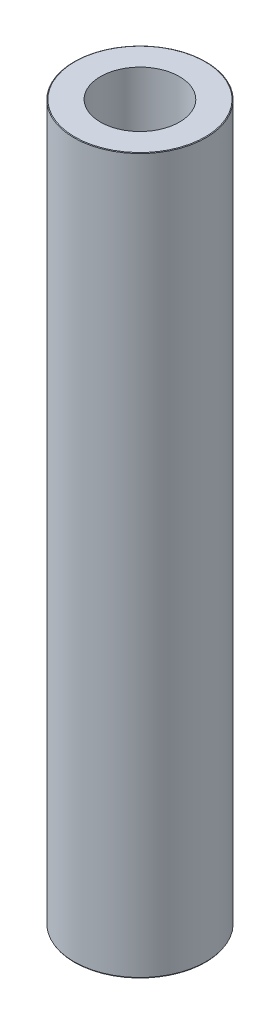
ISO-10303-21;
HEADER;
FILE_DESCRIPTION(('STEP AP214'),'2;1');
FILE_NAME('part.step','',(''),(''),'','','');
FILE_SCHEMA(('AUTOMOTIVE_DESIGN { 1 0 10303 214 1 1 1 1 }'));
ENDSEC;
DATA;
#1=APPLICATION_CONTEXT('core data for automotive mechanical design processes');
#2=APPLICATION_PROTOCOL_DEFINITION('international standard','automotive_design',2000,#1);
#3=PRODUCT_CONTEXT('',#1,'mechanical');
#4=PRODUCT('Part','Part','',(#3));
#5=PRODUCT_RELATED_PRODUCT_CATEGORY('part','',(#4));
#6=PRODUCT_DEFINITION_FORMATION('','',#4);
#7=PRODUCT_DEFINITION_CONTEXT('part definition',#1,'design');
#8=PRODUCT_DEFINITION('design','',#6,#7);
#9=PRODUCT_DEFINITION_SHAPE('','',#8);
#10=(LENGTH_UNIT() NAMED_UNIT(*) SI_UNIT(.MILLI.,.METRE.));
#11=(NAMED_UNIT(*) PLANE_ANGLE_UNIT() SI_UNIT($,.RADIAN.));
#12=(NAMED_UNIT(*) SI_UNIT($,.STERADIAN.) SOLID_ANGLE_UNIT());
#13=UNCERTAINTY_MEASURE_WITH_UNIT(LENGTH_MEASURE(1.E-05),#10,'distance_accuracy_value','');
#14=(GEOMETRIC_REPRESENTATION_CONTEXT(3) GLOBAL_UNCERTAINTY_ASSIGNED_CONTEXT((#13)) GLOBAL_UNIT_ASSIGNED_CONTEXT((#10,
#11,#12)) REPRESENTATION_CONTEXT('',''));
#15=CARTESIAN_POINT('',(0.,0.,0.));
#16=DIRECTION('',(0.,0.,1.));
#17=DIRECTION('',(1.,0.,0.));
#18=AXIS2_PLACEMENT_3D('',#15,#16,#17);
#19=CARTESIAN_POINT('',(0.,433.719628147635,0.));
#20=DIRECTION('',(0.,-1.,0.));
#21=DIRECTION('',(0.,0.,-1.));
#22=AXIS2_PLACEMENT_3D('',#19,#20,#21);
#23=CYLINDRICAL_SURFACE('',#22,40.);
#24=CARTESIAN_POINT('',(0.,433.463543889906,0.));
#25=DIRECTION('',(0.,1.,0.));
#26=DIRECTION('',(0.,0.,1.));
#27=AXIS2_PLACEMENT_3D('',#24,#25,#26);
#28=CIRCLE('',#27,40.);
#29=CARTESIAN_POINT('',(0.,433.463543889906,40.));
#30=VERTEX_POINT('',#29);
#31=EDGE_CURVE('E50',#30,#30,#28,.F.);
#32=ORIENTED_EDGE('',*,*,#31,.T.);
#33=EDGE_LOOP('',(#32));
#34=FACE_BOUND('',#33,.T.);
#35=CARTESIAN_POINT('',(0.,0.443550945404214,0.));
#36=DIRECTION('',(0.,1.,0.));
#37=DIRECTION('',(0.,0.,1.));
#38=AXIS2_PLACEMENT_3D('',#35,#36,#37);
#39=CIRCLE('',#38,40.);
#40=CARTESIAN_POINT('',(0.,0.443550945404214,40.));
#41=VERTEX_POINT('',#40);
#42=EDGE_CURVE('E51',#41,#41,#39,.T.);
#43=ORIENTED_EDGE('',*,*,#42,.T.);
#44=EDGE_LOOP('',(#43));
#45=FACE_BOUND('',#44,.T.);
#46=ADVANCED_FACE('F39',(#34,#45),#23,.T.);
#47=CARTESIAN_POINT('',(0.,433.719628147635,0.));
#48=DIRECTION('',(0.,1.,0.));
#49=DIRECTION('',(0.,0.,1.));
#50=AXIS2_PLACEMENT_3D('',#47,#48,#49);
#51=PLANE('',#50);
#52=CARTESIAN_POINT('',(0.,433.719628147635,0.));
#53=DIRECTION('',(0.,1.,0.));
#54=DIRECTION('',(0.,0.,1.));
#55=AXIS2_PLACEMENT_3D('',#52,#53,#54);
#56=CIRCLE('',#55,39.5564490545958);
#57=CARTESIAN_POINT('',(0.,433.719628147635,39.5564490545958));
#58=VERTEX_POINT('',#57);
#59=EDGE_CURVE('E54',#58,#58,#56,.T.);
#60=ORIENTED_EDGE('',*,*,#59,.T.);
#61=EDGE_LOOP('',(#60));
#62=FACE_BOUND('',#61,.T.);
#63=CARTESIAN_POINT('',(0.,433.719628147635,0.));
#64=DIRECTION('',(0.,1.,0.));
#65=DIRECTION('',(0.,0.,1.));
#66=AXIS2_PLACEMENT_3D('',#63,#64,#65);
#67=CIRCLE('',#66,23.9783136016817);
#68=CARTESIAN_POINT('',(0.,433.719628147635,23.9783136016817));
#69=VERTEX_POINT('',#68);
#70=EDGE_CURVE('E58',#69,#69,#67,.T.);
#71=ORIENTED_EDGE('',*,*,#70,.F.);
#72=EDGE_LOOP('',(#71));
#73=FACE_BOUND('',#72,.T.);
#74=ADVANCED_FACE('F69',(#62,#73),#51,.T.);
#75=CARTESIAN_POINT('',(0.,0.,0.));
#76=DIRECTION('',(0.,1.,0.));
#77=DIRECTION('',(0.,0.,1.));
#78=AXIS2_PLACEMENT_3D('',#75,#76,#77);
#79=PLANE('',#78);
#80=CARTESIAN_POINT('',(0.,0.,0.));
#81=DIRECTION('',(0.,1.,0.));
#82=DIRECTION('',(0.,0.,1.));
#83=AXIS2_PLACEMENT_3D('',#80,#81,#82);
#84=CIRCLE('',#83,39.7439157422716);
#85=CARTESIAN_POINT('',(0.,0.,39.7439157422716));
#86=VERTEX_POINT('',#85);
#87=EDGE_CURVE('E10',#86,#86,#84,.F.);
#88=ORIENTED_EDGE('',*,*,#87,.T.);
#89=EDGE_LOOP('',(#88));
#90=FACE_BOUND('',#89,.T.);
#91=CARTESIAN_POINT('',(0.,0.,0.));
#92=DIRECTION('',(0.,1.,0.));
#93=DIRECTION('',(0.,0.,1.));
#94=AXIS2_PLACEMENT_3D('',#91,#92,#93);
#95=CIRCLE('',#94,23.9783136016817);
#96=CARTESIAN_POINT('',(0.,0.,23.9783136016817));
#97=VERTEX_POINT('',#96);
#98=EDGE_CURVE('E63',#97,#97,#95,.T.);
#99=ORIENTED_EDGE('',*,*,#98,.T.);
#100=EDGE_LOOP('',(#99));
#101=FACE_BOUND('',#100,.T.);
#102=ADVANCED_FACE('F75',(#90,#101),#79,.F.);
#103=CARTESIAN_POINT('',(0.,433.719628147635,0.));
#104=DIRECTION('',(0.,-1.,0.));
#105=DIRECTION('',(0.,0.,-1.));
#106=AXIS2_PLACEMENT_3D('',#103,#104,#105);
#107=CYLINDRICAL_SURFACE('',#106,23.9783136016817);
#108=ORIENTED_EDGE('',*,*,#70,.T.);
#109=EDGE_LOOP('',(#108));
#110=FACE_BOUND('',#109,.T.);
#111=ORIENTED_EDGE('',*,*,#98,.F.);
#112=EDGE_LOOP('',(#111));
#113=FACE_BOUND('',#112,.T.);
#114=ADVANCED_FACE('F70',(#110,#113),#107,.F.);
#115=CARTESIAN_POINT('',(0.,433.719628147635,0.));
#116=DIRECTION('',(0.,-1.,0.));
#117=DIRECTION('',(0.,0.,-1.));
#118=AXIS2_PLACEMENT_3D('',#115,#116,#117);
#119=CONICAL_SURFACE('',#118,39.5564490545958,1.04719755119656);
#120=ORIENTED_EDGE('',*,*,#31,.F.);
#121=EDGE_LOOP('',(#120));
#122=FACE_BOUND('',#121,.T.);
#123=ORIENTED_EDGE('',*,*,#59,.F.);
#124=EDGE_LOOP('',(#123));
#125=FACE_BOUND('',#124,.T.);
#126=ADVANCED_FACE('F81',(#122,#125),#119,.T.);
#127=CARTESIAN_POINT('',(0.,0.443550945404214,0.));
#128=DIRECTION('',(0.,1.,0.));
#129=DIRECTION('',(0.,0.,1.));
#130=AXIS2_PLACEMENT_3D('',#127,#128,#129);
#131=CONICAL_SURFACE('',#130,40.,0.523598775598293);
#132=ORIENTED_EDGE('',*,*,#87,.F.);
#133=EDGE_LOOP('',(#132));
#134=FACE_BOUND('',#133,.T.);
#135=ORIENTED_EDGE('',*,*,#42,.F.);
#136=EDGE_LOOP('',(#135));
#137=FACE_BOUND('',#136,.T.);
#138=ADVANCED_FACE('F45',(#134,#137),#131,.T.);
#139=CLOSED_SHELL('',(#46,#74,#102,#114,#126,#138));
#140=MANIFOLD_SOLID_BREP('B2',#139);
#141=ADVANCED_BREP_SHAPE_REPRESENTATION('',(#18,#140),#14);
#142=SHAPE_DEFINITION_REPRESENTATION(#9,#141);
ENDSEC;
END-ISO-10303-21;
